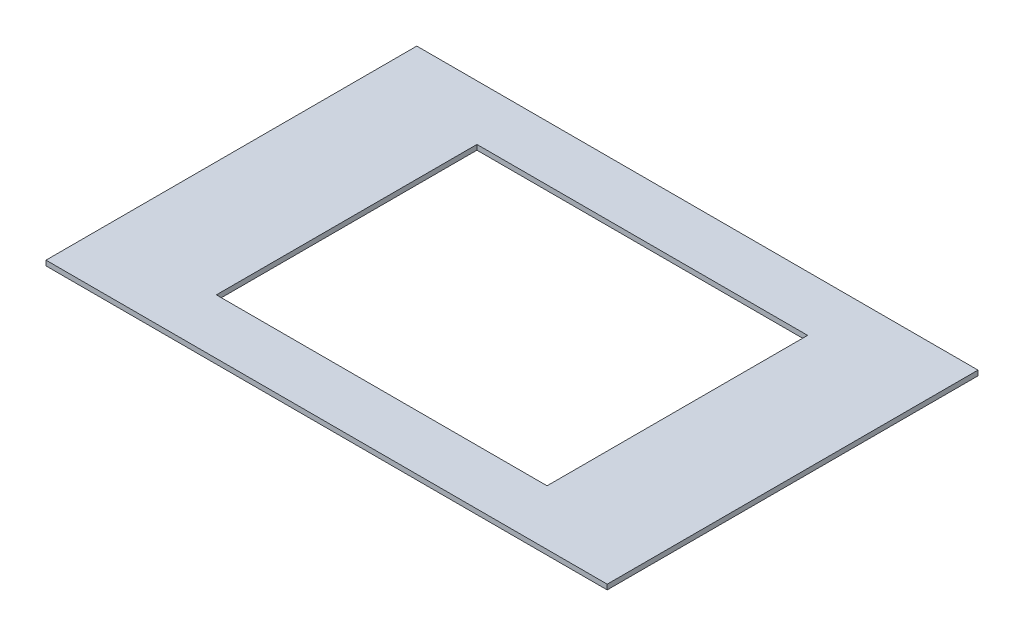
ISO-10303-21;
HEADER;
FILE_DESCRIPTION(('STEP AP214'),'2;1');
FILE_NAME('part.step','',(''),(''),'','','');
FILE_SCHEMA(('AUTOMOTIVE_DESIGN { 1 0 10303 214 1 1 1 1 }'));
ENDSEC;
DATA;
#1=APPLICATION_CONTEXT('core data for automotive mechanical design processes');
#2=APPLICATION_PROTOCOL_DEFINITION('international standard','automotive_design',2000,#1);
#3=PRODUCT_CONTEXT('',#1,'mechanical');
#4=PRODUCT('Part','Part','',(#3));
#5=PRODUCT_RELATED_PRODUCT_CATEGORY('part','',(#4));
#6=PRODUCT_DEFINITION_FORMATION('','',#4);
#7=PRODUCT_DEFINITION_CONTEXT('part definition',#1,'design');
#8=PRODUCT_DEFINITION('design','',#6,#7);
#9=PRODUCT_DEFINITION_SHAPE('','',#8);
#10=(LENGTH_UNIT() NAMED_UNIT(*) SI_UNIT(.MILLI.,.METRE.));
#11=(NAMED_UNIT(*) PLANE_ANGLE_UNIT() SI_UNIT($,.RADIAN.));
#12=(NAMED_UNIT(*) SI_UNIT($,.STERADIAN.) SOLID_ANGLE_UNIT());
#13=UNCERTAINTY_MEASURE_WITH_UNIT(LENGTH_MEASURE(1.E-05),#10,'distance_accuracy_value','');
#14=(GEOMETRIC_REPRESENTATION_CONTEXT(3) GLOBAL_UNCERTAINTY_ASSIGNED_CONTEXT((#13)) GLOBAL_UNIT_ASSIGNED_CONTEXT((#10,
#11,#12)) REPRESENTATION_CONTEXT('',''));
#15=CARTESIAN_POINT('',(0.,0.,0.));
#16=DIRECTION('',(0.,0.,1.));
#17=DIRECTION('',(1.,0.,0.));
#18=AXIS2_PLACEMENT_3D('',#15,#16,#17);
#19=CARTESIAN_POINT('',(56.,1.,-37.));
#20=DIRECTION('',(-1.,0.,0.));
#21=DIRECTION('',(0.,0.,1.));
#22=AXIS2_PLACEMENT_3D('',#19,#20,#21);
#23=PLANE('',#22);
#24=DIRECTION('',(0.,0.,-1.));
#25=VECTOR('',#24,1.);
#26=CARTESIAN_POINT('',(56.,0.,-37.));
#27=LINE('',#26,#25);
#28=CARTESIAN_POINT('',(56.,0.,37.));
#29=VERTEX_POINT('',#28);
#30=CARTESIAN_POINT('',(56.,0.,-37.));
#31=VERTEX_POINT('',#30);
#32=EDGE_CURVE('E141',#29,#31,#27,.T.);
#33=ORIENTED_EDGE('',*,*,#32,.T.);
#34=DIRECTION('',(0.,-1.,0.));
#35=VECTOR('',#34,1.);
#36=CARTESIAN_POINT('',(56.,1.,-37.));
#37=LINE('',#36,#35);
#38=CARTESIAN_POINT('',(56.,1.,-37.));
#39=VERTEX_POINT('',#38);
#40=EDGE_CURVE('E183',#39,#31,#37,.T.);
#41=ORIENTED_EDGE('',*,*,#40,.F.);
#42=DIRECTION('',(0.,0.,-1.));
#43=VECTOR('',#42,1.);
#44=CARTESIAN_POINT('',(56.,1.,-37.));
#45=LINE('',#44,#43);
#46=CARTESIAN_POINT('',(56.,1.,37.));
#47=VERTEX_POINT('',#46);
#48=EDGE_CURVE('E146',#47,#39,#45,.T.);
#49=ORIENTED_EDGE('',*,*,#48,.F.);
#50=DIRECTION('',(0.,-1.,0.));
#51=VECTOR('',#50,1.);
#52=CARTESIAN_POINT('',(56.,1.,37.));
#53=LINE('',#52,#51);
#54=EDGE_CURVE('E160',#47,#29,#53,.T.);
#55=ORIENTED_EDGE('',*,*,#54,.T.);
#56=EDGE_LOOP('',(#33,#41,#49,#55));
#57=FACE_BOUND('',#56,.T.);
#58=ADVANCED_FACE('F45',(#57),#23,.F.);
#59=CARTESIAN_POINT('',(-56.,1.,-37.));
#60=DIRECTION('',(0.,0.,1.));
#61=DIRECTION('',(1.,0.,0.));
#62=AXIS2_PLACEMENT_3D('',#59,#60,#61);
#63=PLANE('',#62);
#64=DIRECTION('',(-1.,0.,0.));
#65=VECTOR('',#64,1.);
#66=CARTESIAN_POINT('',(-56.,0.,-37.));
#67=LINE('',#66,#65);
#68=CARTESIAN_POINT('',(-56.,0.,-37.));
#69=VERTEX_POINT('',#68);
#70=EDGE_CURVE('E164',#31,#69,#67,.T.);
#71=ORIENTED_EDGE('',*,*,#70,.T.);
#72=DIRECTION('',(0.,-1.,0.));
#73=VECTOR('',#72,1.);
#74=CARTESIAN_POINT('',(-56.,1.,-37.));
#75=LINE('',#74,#73);
#76=CARTESIAN_POINT('',(-56.,1.,-37.));
#77=VERTEX_POINT('',#76);
#78=EDGE_CURVE('E179',#77,#69,#75,.T.);
#79=ORIENTED_EDGE('',*,*,#78,.F.);
#80=DIRECTION('',(-1.,0.,0.));
#81=VECTOR('',#80,1.);
#82=CARTESIAN_POINT('',(-56.,1.,-37.));
#83=LINE('',#82,#81);
#84=EDGE_CURVE('E150',#39,#77,#83,.T.);
#85=ORIENTED_EDGE('',*,*,#84,.F.);
#86=ORIENTED_EDGE('',*,*,#40,.T.);
#87=EDGE_LOOP('',(#71,#79,#85,#86));
#88=FACE_BOUND('',#87,.T.);
#89=ADVANCED_FACE('F211',(#88),#63,.F.);
#90=CARTESIAN_POINT('',(-56.,1.,-37.));
#91=DIRECTION('',(1.,0.,0.));
#92=DIRECTION('',(0.,0.,-1.));
#93=AXIS2_PLACEMENT_3D('',#90,#91,#92);
#94=PLANE('',#93);
#95=DIRECTION('',(0.,0.,1.));
#96=VECTOR('',#95,1.);
#97=CARTESIAN_POINT('',(-56.,0.,-37.));
#98=LINE('',#97,#96);
#99=CARTESIAN_POINT('',(-56.,0.,37.));
#100=VERTEX_POINT('',#99);
#101=EDGE_CURVE('E167',#69,#100,#98,.T.);
#102=ORIENTED_EDGE('',*,*,#101,.T.);
#103=DIRECTION('',(0.,-1.,0.));
#104=VECTOR('',#103,1.);
#105=CARTESIAN_POINT('',(-56.,1.,37.));
#106=LINE('',#105,#104);
#107=CARTESIAN_POINT('',(-56.,1.,37.));
#108=VERTEX_POINT('',#107);
#109=EDGE_CURVE('E175',#108,#100,#106,.T.);
#110=ORIENTED_EDGE('',*,*,#109,.F.);
#111=DIRECTION('',(0.,0.,1.));
#112=VECTOR('',#111,1.);
#113=CARTESIAN_POINT('',(-56.,1.,-37.));
#114=LINE('',#113,#112);
#115=EDGE_CURVE('E154',#77,#108,#114,.T.);
#116=ORIENTED_EDGE('',*,*,#115,.F.);
#117=ORIENTED_EDGE('',*,*,#78,.T.);
#118=EDGE_LOOP('',(#102,#110,#116,#117));
#119=FACE_BOUND('',#118,.T.);
#120=ADVANCED_FACE('F216',(#119),#94,.F.);
#121=CARTESIAN_POINT('',(-56.,1.,37.));
#122=DIRECTION('',(0.,0.,-1.));
#123=DIRECTION('',(-1.,0.,0.));
#124=AXIS2_PLACEMENT_3D('',#121,#122,#123);
#125=PLANE('',#124);
#126=DIRECTION('',(1.,0.,0.));
#127=VECTOR('',#126,1.);
#128=CARTESIAN_POINT('',(-56.,0.,37.));
#129=LINE('',#128,#127);
#130=EDGE_CURVE('E151',#100,#29,#129,.T.);
#131=ORIENTED_EDGE('',*,*,#130,.T.);
#132=ORIENTED_EDGE('',*,*,#54,.F.);
#133=DIRECTION('',(1.,0.,0.));
#134=VECTOR('',#133,1.);
#135=CARTESIAN_POINT('',(-56.,1.,37.));
#136=LINE('',#135,#134);
#137=EDGE_CURVE('E157',#108,#47,#136,.T.);
#138=ORIENTED_EDGE('',*,*,#137,.F.);
#139=ORIENTED_EDGE('',*,*,#109,.T.);
#140=EDGE_LOOP('',(#131,#132,#138,#139));
#141=FACE_BOUND('',#140,.T.);
#142=ADVANCED_FACE('F229',(#141),#125,.F.);
#143=CARTESIAN_POINT('',(0.,1.,0.));
#144=DIRECTION('',(0.,1.,0.));
#145=DIRECTION('',(0.,0.,1.));
#146=AXIS2_PLACEMENT_3D('',#143,#144,#145);
#147=PLANE('',#146);
#148=DIRECTION('',(0.,0.,-1.));
#149=VECTOR('',#148,1.);
#150=CARTESIAN_POINT('',(33.,1.,-26.));
#151=LINE('',#150,#149);
#152=CARTESIAN_POINT('',(33.,1.,26.));
#153=VERTEX_POINT('',#152);
#154=CARTESIAN_POINT('',(33.,1.,-26.));
#155=VERTEX_POINT('',#154);
#156=EDGE_CURVE('E60',#153,#155,#151,.T.);
#157=ORIENTED_EDGE('',*,*,#156,.F.);
#158=DIRECTION('',(1.,0.,0.));
#159=VECTOR('',#158,1.);
#160=CARTESIAN_POINT('',(-33.,1.,26.));
#161=LINE('',#160,#159);
#162=CARTESIAN_POINT('',(-33.,1.,26.));
#163=VERTEX_POINT('',#162);
#164=EDGE_CURVE('E131',#163,#153,#161,.T.);
#165=ORIENTED_EDGE('',*,*,#164,.F.);
#166=DIRECTION('',(0.,0.,1.));
#167=VECTOR('',#166,1.);
#168=CARTESIAN_POINT('',(-33.,1.,-26.));
#169=LINE('',#168,#167);
#170=CARTESIAN_POINT('',(-33.,1.,-26.));
#171=VERTEX_POINT('',#170);
#172=EDGE_CURVE('E113',#171,#163,#169,.T.);
#173=ORIENTED_EDGE('',*,*,#172,.F.);
#174=DIRECTION('',(-1.,0.,0.));
#175=VECTOR('',#174,1.);
#176=CARTESIAN_POINT('',(-33.,1.,-26.));
#177=LINE('',#176,#175);
#178=EDGE_CURVE('E123',#155,#171,#177,.T.);
#179=ORIENTED_EDGE('',*,*,#178,.F.);
#180=EDGE_LOOP('',(#157,#165,#173,#179));
#181=FACE_BOUND('',#180,.T.);
#182=ORIENTED_EDGE('',*,*,#48,.T.);
#183=ORIENTED_EDGE('',*,*,#84,.T.);
#184=ORIENTED_EDGE('',*,*,#115,.T.);
#185=ORIENTED_EDGE('',*,*,#137,.T.);
#186=EDGE_LOOP('',(#182,#183,#184,#185));
#187=FACE_BOUND('',#186,.T.);
#188=ADVANCED_FACE('F128',(#181,#187),#147,.T.);
#189=CARTESIAN_POINT('',(0.,0.,0.));
#190=DIRECTION('',(0.,1.,0.));
#191=DIRECTION('',(0.,0.,1.));
#192=AXIS2_PLACEMENT_3D('',#189,#190,#191);
#193=PLANE('',#192);
#194=DIRECTION('',(1.,0.,0.));
#195=VECTOR('',#194,1.);
#196=CARTESIAN_POINT('',(0.,0.,26.));
#197=LINE('',#196,#195);
#198=CARTESIAN_POINT('',(-33.,0.,26.));
#199=VERTEX_POINT('',#198);
#200=CARTESIAN_POINT('',(33.,0.,26.));
#201=VERTEX_POINT('',#200);
#202=EDGE_CURVE('E53',#199,#201,#197,.T.);
#203=ORIENTED_EDGE('',*,*,#202,.T.);
#204=DIRECTION('',(0.,0.,-1.));
#205=VECTOR('',#204,1.);
#206=CARTESIAN_POINT('',(33.,0.,0.));
#207=LINE('',#206,#205);
#208=CARTESIAN_POINT('',(33.,0.,-26.));
#209=VERTEX_POINT('',#208);
#210=EDGE_CURVE('E11',#201,#209,#207,.T.);
#211=ORIENTED_EDGE('',*,*,#210,.T.);
#212=DIRECTION('',(-1.,0.,0.));
#213=VECTOR('',#212,1.);
#214=CARTESIAN_POINT('',(0.,0.,-26.));
#215=LINE('',#214,#213);
#216=CARTESIAN_POINT('',(-33.,0.,-26.));
#217=VERTEX_POINT('',#216);
#218=EDGE_CURVE('E187',#209,#217,#215,.T.);
#219=ORIENTED_EDGE('',*,*,#218,.T.);
#220=DIRECTION('',(0.,0.,1.));
#221=VECTOR('',#220,1.);
#222=CARTESIAN_POINT('',(-33.,0.,0.));
#223=LINE('',#222,#221);
#224=EDGE_CURVE('E116',#217,#199,#223,.T.);
#225=ORIENTED_EDGE('',*,*,#224,.T.);
#226=EDGE_LOOP('',(#203,#211,#219,#225));
#227=FACE_BOUND('',#226,.T.);
#228=ORIENTED_EDGE('',*,*,#32,.F.);
#229=ORIENTED_EDGE('',*,*,#130,.F.);
#230=ORIENTED_EDGE('',*,*,#101,.F.);
#231=ORIENTED_EDGE('',*,*,#70,.F.);
#232=EDGE_LOOP('',(#228,#229,#230,#231));
#233=FACE_BOUND('',#232,.T.);
#234=ADVANCED_FACE('F194',(#227,#233),#193,.F.);
#235=CARTESIAN_POINT('',(33.,-1.,-26.));
#236=DIRECTION('',(1.,0.,0.));
#237=DIRECTION('',(0.,0.,-1.));
#238=AXIS2_PLACEMENT_3D('',#235,#236,#237);
#239=PLANE('',#238);
#240=DIRECTION('',(0.,1.,0.));
#241=VECTOR('',#240,1.);
#242=CARTESIAN_POINT('',(33.,-1.,26.));
#243=LINE('',#242,#241);
#244=EDGE_CURVE('E138',#201,#153,#243,.T.);
#245=ORIENTED_EDGE('',*,*,#244,.T.);
#246=ORIENTED_EDGE('',*,*,#156,.T.);
#247=DIRECTION('',(0.,1.,0.));
#248=VECTOR('',#247,1.);
#249=CARTESIAN_POINT('',(33.,-1.,-26.));
#250=LINE('',#249,#248);
#251=EDGE_CURVE('E120',#209,#155,#250,.T.);
#252=ORIENTED_EDGE('',*,*,#251,.F.);
#253=ORIENTED_EDGE('',*,*,#210,.F.);
#254=EDGE_LOOP('',(#245,#246,#252,#253));
#255=FACE_BOUND('',#254,.T.);
#256=ADVANCED_FACE('F199',(#255),#239,.F.);
#257=CARTESIAN_POINT('',(-33.,-1.,26.));
#258=DIRECTION('',(0.,0.,1.));
#259=DIRECTION('',(1.,0.,0.));
#260=AXIS2_PLACEMENT_3D('',#257,#258,#259);
#261=PLANE('',#260);
#262=DIRECTION('',(0.,1.,0.));
#263=VECTOR('',#262,1.);
#264=CARTESIAN_POINT('',(-33.,-1.,26.));
#265=LINE('',#264,#263);
#266=EDGE_CURVE('E119',#199,#163,#265,.T.);
#267=ORIENTED_EDGE('',*,*,#266,.T.);
#268=ORIENTED_EDGE('',*,*,#164,.T.);
#269=ORIENTED_EDGE('',*,*,#244,.F.);
#270=ORIENTED_EDGE('',*,*,#202,.F.);
#271=EDGE_LOOP('',(#267,#268,#269,#270));
#272=FACE_BOUND('',#271,.T.);
#273=ADVANCED_FACE('F198',(#272),#261,.F.);
#274=CARTESIAN_POINT('',(-33.,-1.,-26.));
#275=DIRECTION('',(-1.,0.,0.));
#276=DIRECTION('',(0.,0.,1.));
#277=AXIS2_PLACEMENT_3D('',#274,#275,#276);
#278=PLANE('',#277);
#279=DIRECTION('',(0.,1.,0.));
#280=VECTOR('',#279,1.);
#281=CARTESIAN_POINT('',(-33.,-1.,-26.));
#282=LINE('',#281,#280);
#283=EDGE_CURVE('E68',#217,#171,#282,.T.);
#284=ORIENTED_EDGE('',*,*,#283,.T.);
#285=ORIENTED_EDGE('',*,*,#172,.T.);
#286=ORIENTED_EDGE('',*,*,#266,.F.);
#287=ORIENTED_EDGE('',*,*,#224,.F.);
#288=EDGE_LOOP('',(#284,#285,#286,#287));
#289=FACE_BOUND('',#288,.T.);
#290=ADVANCED_FACE('F110',(#289),#278,.F.);
#291=CARTESIAN_POINT('',(-33.,-1.,-26.));
#292=DIRECTION('',(0.,0.,-1.));
#293=DIRECTION('',(-1.,0.,0.));
#294=AXIS2_PLACEMENT_3D('',#291,#292,#293);
#295=PLANE('',#294);
#296=ORIENTED_EDGE('',*,*,#251,.T.);
#297=ORIENTED_EDGE('',*,*,#178,.T.);
#298=ORIENTED_EDGE('',*,*,#283,.F.);
#299=ORIENTED_EDGE('',*,*,#218,.F.);
#300=EDGE_LOOP('',(#296,#297,#298,#299));
#301=FACE_BOUND('',#300,.T.);
#302=ADVANCED_FACE('F124',(#301),#295,.F.);
#303=CLOSED_SHELL('',(#58,#89,#120,#142,#188,#234,#256,#273,#290,#302));
#304=MANIFOLD_SOLID_BREP('B2',#303);
#305=ADVANCED_BREP_SHAPE_REPRESENTATION('',(#18,#304),#14);
#306=SHAPE_DEFINITION_REPRESENTATION(#9,#305);
ENDSEC;
END-ISO-10303-21;
